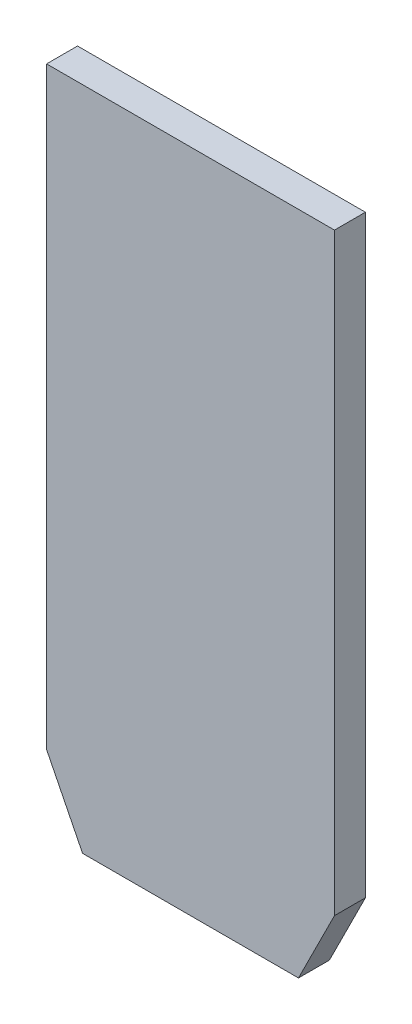
ISO-10303-21;
HEADER;
FILE_DESCRIPTION(('STEP AP214'),'2;1');
FILE_NAME('part.step','',(''),(''),'','','');
FILE_SCHEMA(('AUTOMOTIVE_DESIGN { 1 0 10303 214 1 1 1 1 }'));
ENDSEC;
DATA;
#1=APPLICATION_CONTEXT('core data for automotive mechanical design processes');
#2=APPLICATION_PROTOCOL_DEFINITION('international standard','automotive_design',2000,#1);
#3=PRODUCT_CONTEXT('',#1,'mechanical');
#4=PRODUCT('Part','Part','',(#3));
#5=PRODUCT_RELATED_PRODUCT_CATEGORY('part','',(#4));
#6=PRODUCT_DEFINITION_FORMATION('','',#4);
#7=PRODUCT_DEFINITION_CONTEXT('part definition',#1,'design');
#8=PRODUCT_DEFINITION('design','',#6,#7);
#9=PRODUCT_DEFINITION_SHAPE('','',#8);
#10=(LENGTH_UNIT() NAMED_UNIT(*) SI_UNIT(.MILLI.,.METRE.));
#11=(NAMED_UNIT(*) PLANE_ANGLE_UNIT() SI_UNIT($,.RADIAN.));
#12=(NAMED_UNIT(*) SI_UNIT($,.STERADIAN.) SOLID_ANGLE_UNIT());
#13=UNCERTAINTY_MEASURE_WITH_UNIT(LENGTH_MEASURE(1.E-05),#10,'distance_accuracy_value','');
#14=(GEOMETRIC_REPRESENTATION_CONTEXT(3) GLOBAL_UNCERTAINTY_ASSIGNED_CONTEXT((#13)) GLOBAL_UNIT_ASSIGNED_CONTEXT((#10,
#11,#12)) REPRESENTATION_CONTEXT('',''));
#15=CARTESIAN_POINT('',(0.,0.,0.));
#16=DIRECTION('',(0.,0.,1.));
#17=DIRECTION('',(1.,0.,0.));
#18=AXIS2_PLACEMENT_3D('',#15,#16,#17);
#19=CARTESIAN_POINT('',(-3.30000000000001,-9.25000000000001,0.473));
#20=DIRECTION('',(0.,-1.,0.));
#21=DIRECTION('',(0.,0.,-1.));
#22=AXIS2_PLACEMENT_3D('',#19,#20,#21);
#23=PLANE('',#22);
#24=DIRECTION('',(0.,0.,1.));
#25=VECTOR('',#24,1.);
#26=CARTESIAN_POINT('',(3.,-9.25000000000002,0.473));
#27=LINE('',#26,#25);
#28=CARTESIAN_POINT('',(2.99999999999999,-9.25000000000001,0.43));
#29=VERTEX_POINT('',#28);
#30=CARTESIAN_POINT('',(2.99999999999999,-9.25000000000001,-0.43));
#31=VERTEX_POINT('',#30);
#32=EDGE_CURVE('E72',#29,#31,#27,.F.);
#33=ORIENTED_EDGE('',*,*,#32,.F.);
#34=DIRECTION('',(1.,0.,0.));
#35=VECTOR('',#34,1.);
#36=CARTESIAN_POINT('',(-4.4,-9.25000000000001,0.43));
#37=LINE('',#36,#35);
#38=CARTESIAN_POINT('',(-2.99999999999999,-9.25000000000001,0.43));
#39=VERTEX_POINT('',#38);
#40=EDGE_CURVE('E109',#39,#29,#37,.T.);
#41=ORIENTED_EDGE('',*,*,#40,.F.);
#42=DIRECTION('',(0.,0.,-1.));
#43=VECTOR('',#42,1.);
#44=CARTESIAN_POINT('',(-2.99999999999999,-9.25000000000001,0.473));
#45=LINE('',#44,#43);
#46=CARTESIAN_POINT('',(-2.99999999999999,-9.25000000000001,-0.43));
#47=VERTEX_POINT('',#46);
#48=EDGE_CURVE('E136',#39,#47,#45,.T.);
#49=ORIENTED_EDGE('',*,*,#48,.T.);
#50=DIRECTION('',(-1.,0.,0.));
#51=VECTOR('',#50,1.);
#52=CARTESIAN_POINT('',(4.4,-9.25000000000001,-0.43));
#53=LINE('',#52,#51);
#54=EDGE_CURVE('E111',#31,#47,#53,.T.);
#55=ORIENTED_EDGE('',*,*,#54,.F.);
#56=EDGE_LOOP('',(#33,#41,#49,#55));
#57=FACE_BOUND('',#56,.T.);
#58=ADVANCED_FACE('F16',(#57),#23,.T.);
#59=CARTESIAN_POINT('',(2.95000000000001,-9.34999999999999,0.473));
#60=DIRECTION('',(0.894427190999916,-0.447213595499958,0.));
#61=DIRECTION('',(0.447213595499958,0.894427190999916,0.));
#62=AXIS2_PLACEMENT_3D('',#59,#60,#61);
#63=PLANE('',#62);
#64=DIRECTION('',(0.447213595499963,0.894427190999914,0.));
#65=VECTOR('',#64,1.);
#66=CARTESIAN_POINT('',(2.99999999999999,-9.25000000000001,0.43));
#67=LINE('',#66,#65);
#68=CARTESIAN_POINT('',(4.,-7.25000000000001,0.43));
#69=VERTEX_POINT('',#68);
#70=EDGE_CURVE('E106',#29,#69,#67,.T.);
#71=ORIENTED_EDGE('',*,*,#70,.F.);
#72=ORIENTED_EDGE('',*,*,#32,.T.);
#73=DIRECTION('',(-0.447213595499962,-0.894427190999914,0.));
#74=VECTOR('',#73,1.);
#75=CARTESIAN_POINT('',(4.,-7.25000000000001,-0.43));
#76=LINE('',#75,#74);
#77=CARTESIAN_POINT('',(4.,-7.25000000000001,-0.43));
#78=VERTEX_POINT('',#77);
#79=EDGE_CURVE('E114',#78,#31,#76,.T.);
#80=ORIENTED_EDGE('',*,*,#79,.F.);
#81=DIRECTION('',(0.,0.,-1.));
#82=VECTOR('',#81,1.);
#83=CARTESIAN_POINT('',(4.,-7.25000000000001,0.473));
#84=LINE('',#83,#82);
#85=EDGE_CURVE('E64',#69,#78,#84,.T.);
#86=ORIENTED_EDGE('',*,*,#85,.F.);
#87=EDGE_LOOP('',(#71,#72,#80,#86));
#88=FACE_BOUND('',#87,.T.);
#89=ADVANCED_FACE('F121',(#88),#63,.T.);
#90=CARTESIAN_POINT('',(4.,-8.07500000000001,0.473));
#91=DIRECTION('',(1.,0.,0.));
#92=DIRECTION('',(0.,0.,-1.));
#93=AXIS2_PLACEMENT_3D('',#90,#91,#92);
#94=PLANE('',#93);
#95=DIRECTION('',(0.,0.,1.));
#96=VECTOR('',#95,1.);
#97=CARTESIAN_POINT('',(4.,9.25000000000001,-0.473));
#98=LINE('',#97,#96);
#99=CARTESIAN_POINT('',(4.,9.25000000000001,0.43));
#100=VERTEX_POINT('',#99);
#101=CARTESIAN_POINT('',(4.,9.25000000000001,-0.43));
#102=VERTEX_POINT('',#101);
#103=EDGE_CURVE('E78',#100,#102,#98,.F.);
#104=ORIENTED_EDGE('',*,*,#103,.F.);
#105=DIRECTION('',(0.,1.,0.));
#106=VECTOR('',#105,1.);
#107=CARTESIAN_POINT('',(4.,-10.175,0.43));
#108=LINE('',#107,#106);
#109=EDGE_CURVE('E103',#69,#100,#108,.T.);
#110=ORIENTED_EDGE('',*,*,#109,.F.);
#111=ORIENTED_EDGE('',*,*,#85,.T.);
#112=DIRECTION('',(0.,1.,0.));
#113=VECTOR('',#112,1.);
#114=CARTESIAN_POINT('',(4.,-10.175,-0.43));
#115=LINE('',#114,#113);
#116=EDGE_CURVE('E92',#102,#78,#115,.F.);
#117=ORIENTED_EDGE('',*,*,#116,.F.);
#118=EDGE_LOOP('',(#104,#110,#111,#117));
#119=FACE_BOUND('',#118,.T.);
#120=ADVANCED_FACE('F119',(#119),#94,.T.);
#121=CARTESIAN_POINT('',(-4.4,9.25000000000001,-0.473));
#122=DIRECTION('',(0.,1.,0.));
#123=DIRECTION('',(0.,0.,1.));
#124=AXIS2_PLACEMENT_3D('',#121,#122,#123);
#125=PLANE('',#124);
#126=DIRECTION('',(-1.,0.,0.));
#127=VECTOR('',#126,1.);
#128=CARTESIAN_POINT('',(4.4,9.25000000000001,-0.43));
#129=LINE('',#128,#127);
#130=CARTESIAN_POINT('',(-4.,9.25000000000001,-0.43));
#131=VERTEX_POINT('',#130);
#132=EDGE_CURVE('E88',#131,#102,#129,.F.);
#133=ORIENTED_EDGE('',*,*,#132,.F.);
#134=DIRECTION('',(0.,0.,1.));
#135=VECTOR('',#134,1.);
#136=CARTESIAN_POINT('',(-4.,9.25000000000001,-0.473));
#137=LINE('',#136,#135);
#138=CARTESIAN_POINT('',(-4.,9.25000000000001,0.43));
#139=VERTEX_POINT('',#138);
#140=EDGE_CURVE('E52',#139,#131,#137,.F.);
#141=ORIENTED_EDGE('',*,*,#140,.F.);
#142=DIRECTION('',(1.,0.,0.));
#143=VECTOR('',#142,1.);
#144=CARTESIAN_POINT('',(-4.4,9.25000000000001,0.43));
#145=LINE('',#144,#143);
#146=EDGE_CURVE('E101',#100,#139,#145,.F.);
#147=ORIENTED_EDGE('',*,*,#146,.F.);
#148=ORIENTED_EDGE('',*,*,#103,.T.);
#149=EDGE_LOOP('',(#133,#141,#147,#148));
#150=FACE_BOUND('',#149,.T.);
#151=ADVANCED_FACE('F89',(#150),#125,.T.);
#152=CARTESIAN_POINT('',(-4.,-8.07500000000001,-0.473));
#153=DIRECTION('',(-1.,0.,0.));
#154=DIRECTION('',(0.,0.,1.));
#155=AXIS2_PLACEMENT_3D('',#152,#153,#154);
#156=PLANE('',#155);
#157=ORIENTED_EDGE('',*,*,#140,.T.);
#158=DIRECTION('',(0.,1.,0.));
#159=VECTOR('',#158,1.);
#160=CARTESIAN_POINT('',(-4.,-10.175,-0.43));
#161=LINE('',#160,#159);
#162=CARTESIAN_POINT('',(-4.,-7.25000000000001,-0.43));
#163=VERTEX_POINT('',#162);
#164=EDGE_CURVE('E82',#163,#131,#161,.T.);
#165=ORIENTED_EDGE('',*,*,#164,.F.);
#166=DIRECTION('',(0.,0.,1.));
#167=VECTOR('',#166,1.);
#168=CARTESIAN_POINT('',(-4.,-7.25000000000001,-0.473));
#169=LINE('',#168,#167);
#170=CARTESIAN_POINT('',(-4.,-7.25000000000001,0.43));
#171=VERTEX_POINT('',#170);
#172=EDGE_CURVE('E33',#163,#171,#169,.T.);
#173=ORIENTED_EDGE('',*,*,#172,.T.);
#174=DIRECTION('',(0.,1.,0.));
#175=VECTOR('',#174,1.);
#176=CARTESIAN_POINT('',(-4.,-10.175,0.43));
#177=LINE('',#176,#175);
#178=EDGE_CURVE('E84',#139,#171,#177,.F.);
#179=ORIENTED_EDGE('',*,*,#178,.F.);
#180=EDGE_LOOP('',(#157,#165,#173,#179));
#181=FACE_BOUND('',#180,.T.);
#182=ADVANCED_FACE('F80',(#181),#156,.T.);
#183=CARTESIAN_POINT('',(4.4,-10.175,-0.43));
#184=DIRECTION('',(0.,0.,-1.));
#185=DIRECTION('',(-1.,0.,0.));
#186=AXIS2_PLACEMENT_3D('',#183,#184,#185);
#187=PLANE('',#186);
#188=ORIENTED_EDGE('',*,*,#79,.T.);
#189=ORIENTED_EDGE('',*,*,#54,.T.);
#190=DIRECTION('',(0.447213595499958,-0.894427190999916,0.));
#191=VECTOR('',#190,1.);
#192=CARTESIAN_POINT('',(-2.95000000000001,-9.34999999999999,-0.43));
#193=LINE('',#192,#191);
#194=EDGE_CURVE('E20',#163,#47,#193,.T.);
#195=ORIENTED_EDGE('',*,*,#194,.F.);
#196=ORIENTED_EDGE('',*,*,#164,.T.);
#197=ORIENTED_EDGE('',*,*,#132,.T.);
#198=ORIENTED_EDGE('',*,*,#116,.T.);
#199=EDGE_LOOP('',(#188,#189,#195,#196,#197,#198));
#200=FACE_BOUND('',#199,.T.);
#201=ADVANCED_FACE('F95',(#200),#187,.T.);
#202=CARTESIAN_POINT('',(-4.4,-10.175,0.43));
#203=DIRECTION('',(0.,0.,1.));
#204=DIRECTION('',(1.,0.,0.));
#205=AXIS2_PLACEMENT_3D('',#202,#203,#204);
#206=PLANE('',#205);
#207=ORIENTED_EDGE('',*,*,#146,.T.);
#208=ORIENTED_EDGE('',*,*,#178,.T.);
#209=DIRECTION('',(0.447213595499958,-0.894427190999916,0.));
#210=VECTOR('',#209,1.);
#211=CARTESIAN_POINT('',(-2.95000000000001,-9.34999999999999,0.43));
#212=LINE('',#211,#210);
#213=EDGE_CURVE('E10',#39,#171,#212,.F.);
#214=ORIENTED_EDGE('',*,*,#213,.F.);
#215=ORIENTED_EDGE('',*,*,#40,.T.);
#216=ORIENTED_EDGE('',*,*,#70,.T.);
#217=ORIENTED_EDGE('',*,*,#109,.T.);
#218=EDGE_LOOP('',(#207,#208,#214,#215,#216,#217));
#219=FACE_BOUND('',#218,.T.);
#220=ADVANCED_FACE('F132',(#219),#206,.T.);
#221=CARTESIAN_POINT('',(-2.95000000000001,-9.34999999999999,-0.473));
#222=DIRECTION('',(-0.894427190999916,-0.447213595499958,0.));
#223=DIRECTION('',(0.447213595499958,-0.894427190999916,0.));
#224=AXIS2_PLACEMENT_3D('',#221,#222,#223);
#225=PLANE('',#224);
#226=ORIENTED_EDGE('',*,*,#213,.T.);
#227=ORIENTED_EDGE('',*,*,#172,.F.);
#228=ORIENTED_EDGE('',*,*,#194,.T.);
#229=ORIENTED_EDGE('',*,*,#48,.F.);
#230=EDGE_LOOP('',(#226,#227,#228,#229));
#231=FACE_BOUND('',#230,.T.);
#232=ADVANCED_FACE('F18',(#231),#225,.T.);
#233=CLOSED_SHELL('',(#58,#89,#120,#151,#182,#201,#220,#232));
#234=MANIFOLD_SOLID_BREP('B1',#233);
#235=ADVANCED_BREP_SHAPE_REPRESENTATION('',(#18,#234),#14);
#236=SHAPE_DEFINITION_REPRESENTATION(#9,#235);
ENDSEC;
END-ISO-10303-21;
